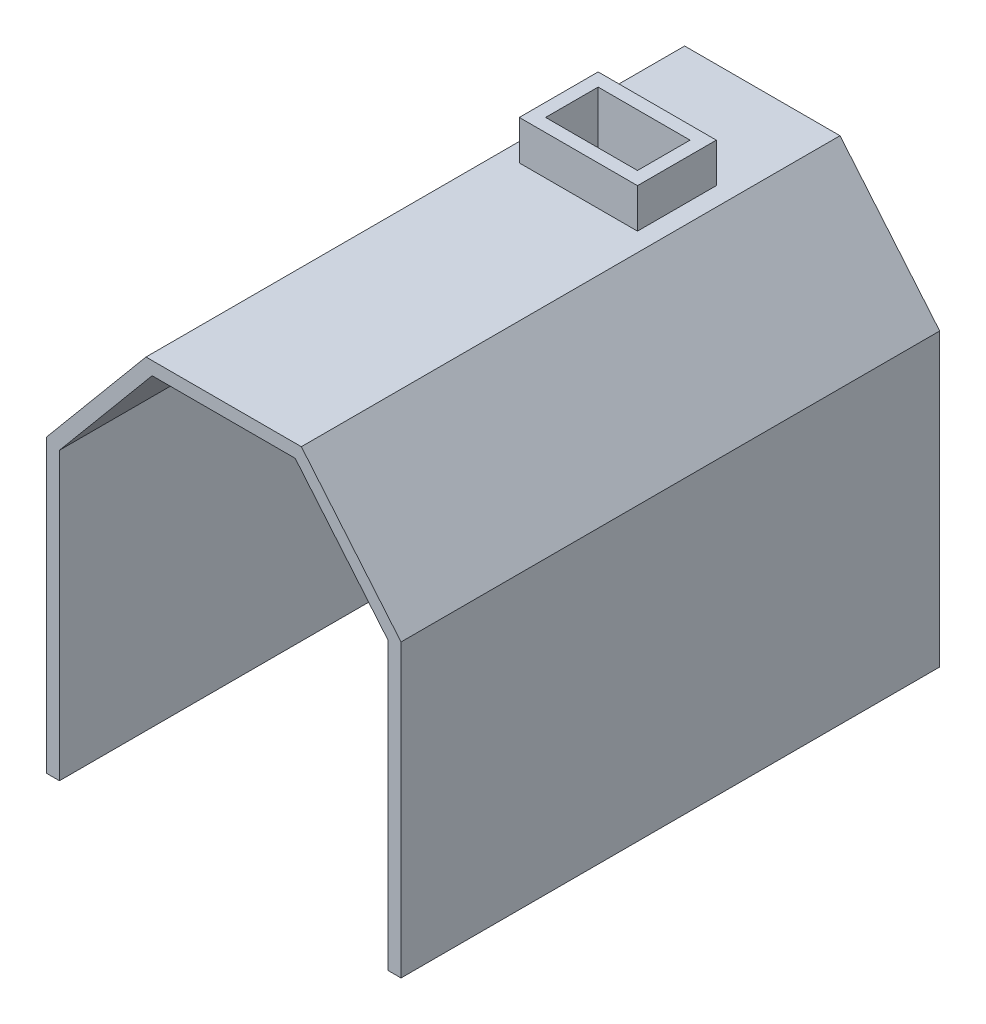
ISO-10303-21;
HEADER;
FILE_DESCRIPTION(('STEP AP214'),'2;1');
FILE_NAME('part.step','',(''),(''),'','','');
FILE_SCHEMA(('AUTOMOTIVE_DESIGN { 1 0 10303 214 1 1 1 1 }'));
ENDSEC;
DATA;
#1=APPLICATION_CONTEXT('core data for automotive mechanical design processes');
#2=APPLICATION_PROTOCOL_DEFINITION('international standard','automotive_design',2000,#1);
#3=PRODUCT_CONTEXT('',#1,'mechanical');
#4=PRODUCT('Part','Part','',(#3));
#5=PRODUCT_RELATED_PRODUCT_CATEGORY('part','',(#4));
#6=PRODUCT_DEFINITION_FORMATION('','',#4);
#7=PRODUCT_DEFINITION_CONTEXT('part definition',#1,'design');
#8=PRODUCT_DEFINITION('design','',#6,#7);
#9=PRODUCT_DEFINITION_SHAPE('','',#8);
#10=(LENGTH_UNIT() NAMED_UNIT(*) SI_UNIT(.MILLI.,.METRE.));
#11=(NAMED_UNIT(*) PLANE_ANGLE_UNIT() SI_UNIT($,.RADIAN.));
#12=(NAMED_UNIT(*) SI_UNIT($,.STERADIAN.) SOLID_ANGLE_UNIT());
#13=UNCERTAINTY_MEASURE_WITH_UNIT(LENGTH_MEASURE(1.E-05),#10,'distance_accuracy_value','');
#14=(GEOMETRIC_REPRESENTATION_CONTEXT(3) GLOBAL_UNCERTAINTY_ASSIGNED_CONTEXT((#13)) GLOBAL_UNIT_ASSIGNED_CONTEXT((#10,
#11,#12)) REPRESENTATION_CONTEXT('',''));
#15=CARTESIAN_POINT('',(0.,0.,0.));
#16=DIRECTION('',(0.,0.,1.));
#17=DIRECTION('',(1.,0.,0.));
#18=AXIS2_PLACEMENT_3D('',#15,#16,#17);
#19=CARTESIAN_POINT('',(-59.1248825999998,203.35,205.));
#20=DIRECTION('',(0.,-1.,0.));
#21=DIRECTION('',(0.,0.,-1.));
#22=AXIS2_PLACEMENT_3D('',#19,#20,#21);
#23=PLANE('',#22);
#24=DIRECTION('',(-1.,0.,0.));
#25=VECTOR('',#24,1.);
#26=CARTESIAN_POINT('',(-59.1248825999998,203.35,-205.));
#27=LINE('',#26,#25);
#28=CARTESIAN_POINT('',(59.1248825999997,203.35,-205.));
#29=VERTEX_POINT('',#28);
#30=CARTESIAN_POINT('',(-59.1248825999998,203.35,-205.));
#31=VERTEX_POINT('',#30);
#32=EDGE_CURVE('E296',#29,#31,#27,.T.);
#33=ORIENTED_EDGE('',*,*,#32,.T.);
#34=DIRECTION('',(0.,0.,-1.));
#35=VECTOR('',#34,1.);
#36=CARTESIAN_POINT('',(-59.1248825999998,203.35,205.));
#37=LINE('',#36,#35);
#38=CARTESIAN_POINT('',(-59.1248825999998,203.35,205.));
#39=VERTEX_POINT('',#38);
#40=EDGE_CURVE('E306',#39,#31,#37,.T.);
#41=ORIENTED_EDGE('',*,*,#40,.F.);
#42=DIRECTION('',(-1.,0.,0.));
#43=VECTOR('',#42,1.);
#44=CARTESIAN_POINT('',(-59.1248825999998,203.35,205.));
#45=LINE('',#44,#43);
#46=CARTESIAN_POINT('',(59.1248825999997,203.35,205.));
#47=VERTEX_POINT('',#46);
#48=EDGE_CURVE('E271',#47,#39,#45,.T.);
#49=ORIENTED_EDGE('',*,*,#48,.F.);
#50=DIRECTION('',(0.,0.,-1.));
#51=VECTOR('',#50,1.);
#52=CARTESIAN_POINT('',(59.1248825999997,203.35,205.));
#53=LINE('',#52,#51);
#54=EDGE_CURVE('E309',#47,#29,#53,.T.);
#55=ORIENTED_EDGE('',*,*,#54,.T.);
#56=EDGE_LOOP('',(#33,#41,#49,#55));
#57=FACE_BOUND('',#56,.T.);
#58=DIRECTION('',(1.,0.,0.));
#59=VECTOR('',#58,1.);
#60=CARTESIAN_POINT('',(-59.1248825999998,203.35,-65.));
#61=LINE('',#60,#59);
#62=CARTESIAN_POINT('',(-44.9749944578664,203.35,-65.));
#63=VERTEX_POINT('',#62);
#64=CARTESIAN_POINT('',(44.9749944578665,203.35,-65.));
#65=VERTEX_POINT('',#64);
#66=EDGE_CURVE('E210',#63,#65,#61,.T.);
#67=ORIENTED_EDGE('',*,*,#66,.F.);
#68=DIRECTION('',(0.,0.,1.));
#69=VECTOR('',#68,1.);
#70=CARTESIAN_POINT('',(-44.9749944578664,203.35,205.));
#71=LINE('',#70,#69);
#72=CARTESIAN_POINT('',(-44.9749944578664,203.35,-125.));
#73=VERTEX_POINT('',#72);
#74=EDGE_CURVE('E215',#73,#63,#71,.T.);
#75=ORIENTED_EDGE('',*,*,#74,.F.);
#76=DIRECTION('',(-1.,0.,0.));
#77=VECTOR('',#76,1.);
#78=CARTESIAN_POINT('',(-59.1248825999998,203.35,-125.));
#79=LINE('',#78,#77);
#80=CARTESIAN_POINT('',(44.9749944578665,203.35,-125.));
#81=VERTEX_POINT('',#80);
#82=EDGE_CURVE('E65',#81,#73,#79,.T.);
#83=ORIENTED_EDGE('',*,*,#82,.F.);
#84=DIRECTION('',(0.,0.,-1.));
#85=VECTOR('',#84,1.);
#86=CARTESIAN_POINT('',(44.9749944578665,203.35,205.));
#87=LINE('',#86,#85);
#88=EDGE_CURVE('E60',#65,#81,#87,.T.);
#89=ORIENTED_EDGE('',*,*,#88,.F.);
#90=EDGE_LOOP('',(#67,#75,#83,#89));
#91=FACE_BOUND('',#90,.T.);
#92=ADVANCED_FACE('F45',(#57,#91),#23,.F.);
#93=CARTESIAN_POINT('',(-54.4500000000001,193.35,205.));
#94=DIRECTION('',(0.,1.,0.));
#95=DIRECTION('',(0.,0.,1.));
#96=AXIS2_PLACEMENT_3D('',#93,#94,#95);
#97=PLANE('',#96);
#98=DIRECTION('',(1.,0.,0.));
#99=VECTOR('',#98,1.);
#100=CARTESIAN_POINT('',(-54.4500000000001,193.35,-205.));
#101=LINE('',#100,#99);
#102=CARTESIAN_POINT('',(-54.4500000000001,193.35,-205.));
#103=VERTEX_POINT('',#102);
#104=CARTESIAN_POINT('',(54.4499999999999,193.35,-205.));
#105=VERTEX_POINT('',#104);
#106=EDGE_CURVE('E284',#103,#105,#101,.T.);
#107=ORIENTED_EDGE('',*,*,#106,.T.);
#108=DIRECTION('',(0.,0.,-1.));
#109=VECTOR('',#108,1.);
#110=CARTESIAN_POINT('',(54.4499999999999,193.35,205.));
#111=LINE('',#110,#109);
#112=CARTESIAN_POINT('',(54.4499999999999,193.35,205.));
#113=VERTEX_POINT('',#112);
#114=EDGE_CURVE('E324',#113,#105,#111,.T.);
#115=ORIENTED_EDGE('',*,*,#114,.F.);
#116=DIRECTION('',(1.,0.,0.));
#117=VECTOR('',#116,1.);
#118=CARTESIAN_POINT('',(-54.4500000000001,193.35,205.));
#119=LINE('',#118,#117);
#120=CARTESIAN_POINT('',(-54.4500000000001,193.35,205.));
#121=VERTEX_POINT('',#120);
#122=EDGE_CURVE('E259',#121,#113,#119,.T.);
#123=ORIENTED_EDGE('',*,*,#122,.F.);
#124=DIRECTION('',(0.,0.,-1.));
#125=VECTOR('',#124,1.);
#126=CARTESIAN_POINT('',(-54.4500000000001,193.35,205.));
#127=LINE('',#126,#125);
#128=EDGE_CURVE('E327',#121,#103,#127,.T.);
#129=ORIENTED_EDGE('',*,*,#128,.T.);
#130=EDGE_LOOP('',(#107,#115,#123,#129));
#131=FACE_BOUND('',#130,.T.);
#132=DIRECTION('',(0.,0.,-1.));
#133=VECTOR('',#132,1.);
#134=CARTESIAN_POINT('',(-34.9749944578665,193.35,205.));
#135=LINE('',#134,#133);
#136=CARTESIAN_POINT('',(-34.9749944578664,193.35,-75.));
#137=VERTEX_POINT('',#136);
#138=CARTESIAN_POINT('',(-34.9749944578664,193.35,-115.));
#139=VERTEX_POINT('',#138);
#140=EDGE_CURVE('E247',#137,#139,#135,.T.);
#141=ORIENTED_EDGE('',*,*,#140,.F.);
#142=DIRECTION('',(-1.,0.,0.));
#143=VECTOR('',#142,1.);
#144=CARTESIAN_POINT('',(-54.4500000000001,193.35,-75.));
#145=LINE('',#144,#143);
#146=CARTESIAN_POINT('',(34.9749944578665,193.35,-75.0000000000001));
#147=VERTEX_POINT('',#146);
#148=EDGE_CURVE('E245',#147,#137,#145,.T.);
#149=ORIENTED_EDGE('',*,*,#148,.F.);
#150=DIRECTION('',(0.,0.,1.));
#151=VECTOR('',#150,1.);
#152=CARTESIAN_POINT('',(34.9749944578665,193.35,205.));
#153=LINE('',#152,#151);
#154=CARTESIAN_POINT('',(34.9749944578665,193.35,-115.));
#155=VERTEX_POINT('',#154);
#156=EDGE_CURVE('E188',#155,#147,#153,.T.);
#157=ORIENTED_EDGE('',*,*,#156,.F.);
#158=DIRECTION('',(1.,0.,0.));
#159=VECTOR('',#158,1.);
#160=CARTESIAN_POINT('',(-54.4500000000001,193.35,-115.));
#161=LINE('',#160,#159);
#162=EDGE_CURVE('E242',#139,#155,#161,.T.);
#163=ORIENTED_EDGE('',*,*,#162,.F.);
#164=EDGE_LOOP('',(#141,#149,#157,#163));
#165=FACE_BOUND('',#164,.T.);
#166=ADVANCED_FACE('F345',(#131,#165),#97,.F.);
#167=CARTESIAN_POINT('',(-135.,-108.94,205.));
#168=DIRECTION('',(0.,1.,0.));
#169=DIRECTION('',(-1.,0.,0.));
#170=AXIS2_PLACEMENT_3D('',#167,#168,#169);
#171=PLANE('',#170);
#172=DIRECTION('',(1.,0.,0.));
#173=VECTOR('',#172,1.);
#174=CARTESIAN_POINT('',(-135.,-108.94,-205.));
#175=LINE('',#174,#173);
#176=CARTESIAN_POINT('',(-135.,-108.94,-205.));
#177=VERTEX_POINT('',#176);
#178=CARTESIAN_POINT('',(-125.,-108.94,-205.));
#179=VERTEX_POINT('',#178);
#180=EDGE_CURVE('E250',#177,#179,#175,.T.);
#181=ORIENTED_EDGE('',*,*,#180,.T.);
#182=DIRECTION('',(0.,0.,-1.));
#183=VECTOR('',#182,1.);
#184=CARTESIAN_POINT('',(-125.,-108.94,205.));
#185=LINE('',#184,#183);
#186=CARTESIAN_POINT('',(-125.,-108.94,205.));
#187=VERTEX_POINT('',#186);
#188=EDGE_CURVE('E11',#187,#179,#185,.T.);
#189=ORIENTED_EDGE('',*,*,#188,.F.);
#190=DIRECTION('',(1.,0.,0.));
#191=VECTOR('',#190,1.);
#192=CARTESIAN_POINT('',(-135.,-108.94,205.));
#193=LINE('',#192,#191);
#194=CARTESIAN_POINT('',(-135.,-108.94,205.));
#195=VERTEX_POINT('',#194);
#196=EDGE_CURVE('E251',#195,#187,#193,.T.);
#197=ORIENTED_EDGE('',*,*,#196,.F.);
#198=DIRECTION('',(0.,0.,-1.));
#199=VECTOR('',#198,1.);
#200=CARTESIAN_POINT('',(-135.,-108.94,205.));
#201=LINE('',#200,#199);
#202=EDGE_CURVE('E277',#195,#177,#201,.T.);
#203=ORIENTED_EDGE('',*,*,#202,.T.);
#204=EDGE_LOOP('',(#181,#189,#197,#203));
#205=FACE_BOUND('',#204,.T.);
#206=ADVANCED_FACE('F47',(#205),#171,.F.);
#207=CARTESIAN_POINT('',(-125.,108.94,205.));
#208=DIRECTION('',(-1.,0.,0.));
#209=DIRECTION('',(0.,-1.,0.));
#210=AXIS2_PLACEMENT_3D('',#207,#208,#209);
#211=PLANE('',#210);
#212=DIRECTION('',(0.,1.,0.));
#213=VECTOR('',#212,1.);
#214=CARTESIAN_POINT('',(-125.,108.94,-205.));
#215=LINE('',#214,#213);
#216=CARTESIAN_POINT('',(-125.,108.94,-205.));
#217=VERTEX_POINT('',#216);
#218=EDGE_CURVE('E280',#179,#217,#215,.T.);
#219=ORIENTED_EDGE('',*,*,#218,.T.);
#220=DIRECTION('',(0.,0.,-1.));
#221=VECTOR('',#220,1.);
#222=CARTESIAN_POINT('',(-125.,108.94,205.));
#223=LINE('',#222,#221);
#224=CARTESIAN_POINT('',(-125.,108.94,205.));
#225=VERTEX_POINT('',#224);
#226=EDGE_CURVE('E53',#225,#217,#223,.T.);
#227=ORIENTED_EDGE('',*,*,#226,.F.);
#228=DIRECTION('',(0.,1.,0.));
#229=VECTOR('',#228,1.);
#230=CARTESIAN_POINT('',(-125.,108.94,205.));
#231=LINE('',#230,#229);
#232=EDGE_CURVE('E254',#187,#225,#231,.T.);
#233=ORIENTED_EDGE('',*,*,#232,.F.);
#234=ORIENTED_EDGE('',*,*,#188,.T.);
#235=EDGE_LOOP('',(#219,#227,#233,#234));
#236=FACE_BOUND('',#235,.T.);
#237=ADVANCED_FACE('F358',(#236),#211,.F.);
#238=CARTESIAN_POINT('',(-125.,108.94,205.));
#239=DIRECTION('',(-0.767289111479314,0.641301348357607,0.));
#240=DIRECTION('',(-0.641301348357607,-0.767289111479314,0.));
#241=AXIS2_PLACEMENT_3D('',#238,#239,#240);
#242=PLANE('',#241);
#243=DIRECTION('',(0.641301348357607,0.767289111479314,0.));
#244=VECTOR('',#243,1.);
#245=CARTESIAN_POINT('',(-125.,108.94,-205.));
#246=LINE('',#245,#244);
#247=EDGE_CURVE('E282',#217,#103,#246,.T.);
#248=ORIENTED_EDGE('',*,*,#247,.T.);
#249=ORIENTED_EDGE('',*,*,#128,.F.);
#250=DIRECTION('',(0.641301348357607,0.767289111479314,0.));
#251=VECTOR('',#250,1.);
#252=CARTESIAN_POINT('',(-125.,108.94,205.));
#253=LINE('',#252,#251);
#254=EDGE_CURVE('E257',#225,#121,#253,.T.);
#255=ORIENTED_EDGE('',*,*,#254,.F.);
#256=ORIENTED_EDGE('',*,*,#226,.T.);
#257=EDGE_LOOP('',(#248,#249,#255,#256));
#258=FACE_BOUND('',#257,.T.);
#259=ADVANCED_FACE('F334',(#258),#242,.F.);
#260=CARTESIAN_POINT('',(125.,108.94,205.));
#261=DIRECTION('',(0.767289111479314,0.641301348357607,0.));
#262=DIRECTION('',(-0.641301348357607,0.767289111479314,0.));
#263=AXIS2_PLACEMENT_3D('',#260,#261,#262);
#264=PLANE('',#263);
#265=DIRECTION('',(0.641301348357607,-0.767289111479314,0.));
#266=VECTOR('',#265,1.);
#267=CARTESIAN_POINT('',(125.,108.94,-205.));
#268=LINE('',#267,#266);
#269=CARTESIAN_POINT('',(125.,108.94,-205.));
#270=VERTEX_POINT('',#269);
#271=EDGE_CURVE('E286',#105,#270,#268,.T.);
#272=ORIENTED_EDGE('',*,*,#271,.T.);
#273=DIRECTION('',(0.,0.,-1.));
#274=VECTOR('',#273,1.);
#275=CARTESIAN_POINT('',(125.,108.94,205.));
#276=LINE('',#275,#274);
#277=CARTESIAN_POINT('',(125.,108.94,205.));
#278=VERTEX_POINT('',#277);
#279=EDGE_CURVE('E321',#278,#270,#276,.T.);
#280=ORIENTED_EDGE('',*,*,#279,.F.);
#281=DIRECTION('',(0.641301348357607,-0.767289111479314,0.));
#282=VECTOR('',#281,1.);
#283=CARTESIAN_POINT('',(125.,108.94,205.));
#284=LINE('',#283,#282);
#285=EDGE_CURVE('E261',#113,#278,#284,.T.);
#286=ORIENTED_EDGE('',*,*,#285,.F.);
#287=ORIENTED_EDGE('',*,*,#114,.T.);
#288=EDGE_LOOP('',(#272,#280,#286,#287));
#289=FACE_BOUND('',#288,.T.);
#290=ADVANCED_FACE('F350',(#289),#264,.F.);
#291=CARTESIAN_POINT('',(125.,108.94,205.));
#292=DIRECTION('',(1.,0.,0.));
#293=DIRECTION('',(0.,1.,0.));
#294=AXIS2_PLACEMENT_3D('',#291,#292,#293);
#295=PLANE('',#294);
#296=DIRECTION('',(0.,-1.,0.));
#297=VECTOR('',#296,1.);
#298=CARTESIAN_POINT('',(125.,108.94,-205.));
#299=LINE('',#298,#297);
#300=CARTESIAN_POINT('',(125.,-108.94,-205.));
#301=VERTEX_POINT('',#300);
#302=EDGE_CURVE('E288',#270,#301,#299,.T.);
#303=ORIENTED_EDGE('',*,*,#302,.T.);
#304=DIRECTION('',(0.,0.,-1.));
#305=VECTOR('',#304,1.);
#306=CARTESIAN_POINT('',(125.,-108.94,205.));
#307=LINE('',#306,#305);
#308=CARTESIAN_POINT('',(125.,-108.94,205.));
#309=VERTEX_POINT('',#308);
#310=EDGE_CURVE('E318',#309,#301,#307,.T.);
#311=ORIENTED_EDGE('',*,*,#310,.F.);
#312=DIRECTION('',(0.,-1.,0.));
#313=VECTOR('',#312,1.);
#314=CARTESIAN_POINT('',(125.,108.94,205.));
#315=LINE('',#314,#313);
#316=EDGE_CURVE('E263',#278,#309,#315,.T.);
#317=ORIENTED_EDGE('',*,*,#316,.F.);
#318=ORIENTED_EDGE('',*,*,#279,.T.);
#319=EDGE_LOOP('',(#303,#311,#317,#318));
#320=FACE_BOUND('',#319,.T.);
#321=ADVANCED_FACE('F390',(#320),#295,.F.);
#322=CARTESIAN_POINT('',(125.,-108.94,205.));
#323=DIRECTION('',(0.,1.,0.));
#324=DIRECTION('',(0.,0.,1.));
#325=AXIS2_PLACEMENT_3D('',#322,#323,#324);
#326=PLANE('',#325);
#327=DIRECTION('',(1.,0.,0.));
#328=VECTOR('',#327,1.);
#329=CARTESIAN_POINT('',(125.,-108.94,-205.));
#330=LINE('',#329,#328);
#331=CARTESIAN_POINT('',(135.,-108.94,-205.));
#332=VERTEX_POINT('',#331);
#333=EDGE_CURVE('E290',#301,#332,#330,.T.);
#334=ORIENTED_EDGE('',*,*,#333,.T.);
#335=DIRECTION('',(0.,0.,-1.));
#336=VECTOR('',#335,1.);
#337=CARTESIAN_POINT('',(135.,-108.94,205.));
#338=LINE('',#337,#336);
#339=CARTESIAN_POINT('',(135.,-108.94,205.));
#340=VERTEX_POINT('',#339);
#341=EDGE_CURVE('E315',#340,#332,#338,.T.);
#342=ORIENTED_EDGE('',*,*,#341,.F.);
#343=DIRECTION('',(1.,0.,0.));
#344=VECTOR('',#343,1.);
#345=CARTESIAN_POINT('',(125.,-108.94,205.));
#346=LINE('',#345,#344);
#347=EDGE_CURVE('E265',#309,#340,#346,.T.);
#348=ORIENTED_EDGE('',*,*,#347,.F.);
#349=ORIENTED_EDGE('',*,*,#310,.T.);
#350=EDGE_LOOP('',(#334,#342,#348,#349));
#351=FACE_BOUND('',#350,.T.);
#352=ADVANCED_FACE('F388',(#351),#326,.F.);
#353=CARTESIAN_POINT('',(135.,112.568729132048,205.));
#354=DIRECTION('',(-1.,0.,0.));
#355=DIRECTION('',(0.,0.,1.));
#356=AXIS2_PLACEMENT_3D('',#353,#354,#355);
#357=PLANE('',#356);
#358=DIRECTION('',(0.,1.,0.));
#359=VECTOR('',#358,1.);
#360=CARTESIAN_POINT('',(135.,112.568729132048,-205.));
#361=LINE('',#360,#359);
#362=CARTESIAN_POINT('',(135.,112.568729132048,-205.));
#363=VERTEX_POINT('',#362);
#364=EDGE_CURVE('E292',#332,#363,#361,.T.);
#365=ORIENTED_EDGE('',*,*,#364,.T.);
#366=DIRECTION('',(0.,0.,-1.));
#367=VECTOR('',#366,1.);
#368=CARTESIAN_POINT('',(135.,112.568729132048,205.));
#369=LINE('',#368,#367);
#370=CARTESIAN_POINT('',(135.,112.568729132048,205.));
#371=VERTEX_POINT('',#370);
#372=EDGE_CURVE('E312',#371,#363,#369,.T.);
#373=ORIENTED_EDGE('',*,*,#372,.F.);
#374=DIRECTION('',(0.,1.,0.));
#375=VECTOR('',#374,1.);
#376=CARTESIAN_POINT('',(135.,112.568729132048,205.));
#377=LINE('',#376,#375);
#378=EDGE_CURVE('E267',#340,#371,#377,.T.);
#379=ORIENTED_EDGE('',*,*,#378,.F.);
#380=ORIENTED_EDGE('',*,*,#341,.T.);
#381=EDGE_LOOP('',(#365,#373,#379,#380));
#382=FACE_BOUND('',#381,.T.);
#383=ADVANCED_FACE('F384',(#382),#357,.F.);
#384=CARTESIAN_POINT('',(135.,112.568729132048,205.));
#385=DIRECTION('',(-0.767289111479314,-0.641301348357607,0.));
#386=DIRECTION('',(0.641301348357607,-0.767289111479314,0.));
#387=AXIS2_PLACEMENT_3D('',#384,#385,#386);
#388=PLANE('',#387);
#389=DIRECTION('',(-0.641301348357607,0.767289111479314,0.));
#390=VECTOR('',#389,1.);
#391=CARTESIAN_POINT('',(135.,112.568729132048,-205.));
#392=LINE('',#391,#390);
#393=EDGE_CURVE('E294',#363,#29,#392,.T.);
#394=ORIENTED_EDGE('',*,*,#393,.T.);
#395=ORIENTED_EDGE('',*,*,#54,.F.);
#396=DIRECTION('',(-0.641301348357607,0.767289111479314,0.));
#397=VECTOR('',#396,1.);
#398=CARTESIAN_POINT('',(135.,112.568729132048,205.));
#399=LINE('',#398,#397);
#400=EDGE_CURVE('E269',#371,#47,#399,.T.);
#401=ORIENTED_EDGE('',*,*,#400,.F.);
#402=ORIENTED_EDGE('',*,*,#372,.T.);
#403=EDGE_LOOP('',(#394,#395,#401,#402));
#404=FACE_BOUND('',#403,.T.);
#405=ADVANCED_FACE('F379',(#404),#388,.F.);
#406=CARTESIAN_POINT('',(-135.,112.568729132048,205.));
#407=DIRECTION('',(0.767289111479314,-0.641301348357607,0.));
#408=DIRECTION('',(0.641301348357607,0.767289111479314,0.));
#409=AXIS2_PLACEMENT_3D('',#406,#407,#408);
#410=PLANE('',#409);
#411=DIRECTION('',(-0.641301348357607,-0.767289111479314,0.));
#412=VECTOR('',#411,1.);
#413=CARTESIAN_POINT('',(-135.,112.568729132048,-205.));
#414=LINE('',#413,#412);
#415=CARTESIAN_POINT('',(-135.,112.568729132048,-205.));
#416=VERTEX_POINT('',#415);
#417=EDGE_CURVE('E298',#31,#416,#414,.T.);
#418=ORIENTED_EDGE('',*,*,#417,.T.);
#419=DIRECTION('',(0.,0.,-1.));
#420=VECTOR('',#419,1.);
#421=CARTESIAN_POINT('',(-135.,112.568729132048,205.));
#422=LINE('',#421,#420);
#423=CARTESIAN_POINT('',(-135.,112.568729132048,205.));
#424=VERTEX_POINT('',#423);
#425=EDGE_CURVE('E303',#424,#416,#422,.T.);
#426=ORIENTED_EDGE('',*,*,#425,.F.);
#427=DIRECTION('',(-0.641301348357607,-0.767289111479314,0.));
#428=VECTOR('',#427,1.);
#429=CARTESIAN_POINT('',(-135.,112.568729132048,205.));
#430=LINE('',#429,#428);
#431=EDGE_CURVE('E273',#39,#424,#430,.T.);
#432=ORIENTED_EDGE('',*,*,#431,.F.);
#433=ORIENTED_EDGE('',*,*,#40,.T.);
#434=EDGE_LOOP('',(#418,#426,#432,#433));
#435=FACE_BOUND('',#434,.T.);
#436=ADVANCED_FACE('F370',(#435),#410,.F.);
#437=CARTESIAN_POINT('',(-135.,112.568729132048,205.));
#438=DIRECTION('',(1.,0.,0.));
#439=DIRECTION('',(0.,0.,-1.));
#440=AXIS2_PLACEMENT_3D('',#437,#438,#439);
#441=PLANE('',#440);
#442=DIRECTION('',(0.,-1.,0.));
#443=VECTOR('',#442,1.);
#444=CARTESIAN_POINT('',(-135.,112.568729132048,-205.));
#445=LINE('',#444,#443);
#446=EDGE_CURVE('E255',#416,#177,#445,.T.);
#447=ORIENTED_EDGE('',*,*,#446,.T.);
#448=ORIENTED_EDGE('',*,*,#202,.F.);
#449=DIRECTION('',(0.,-1.,0.));
#450=VECTOR('',#449,1.);
#451=CARTESIAN_POINT('',(-135.,112.568729132048,205.));
#452=LINE('',#451,#450);
#453=EDGE_CURVE('E275',#424,#195,#452,.T.);
#454=ORIENTED_EDGE('',*,*,#453,.F.);
#455=ORIENTED_EDGE('',*,*,#425,.T.);
#456=EDGE_LOOP('',(#447,#448,#454,#455));
#457=FACE_BOUND('',#456,.T.);
#458=ADVANCED_FACE('F365',(#457),#441,.F.);
#459=CARTESIAN_POINT('',(0.,0.,205.));
#460=DIRECTION('',(0.,0.,-1.));
#461=DIRECTION('',(-1.,0.,0.));
#462=AXIS2_PLACEMENT_3D('',#459,#460,#461);
#463=PLANE('',#462);
#464=ORIENTED_EDGE('',*,*,#196,.T.);
#465=ORIENTED_EDGE('',*,*,#232,.T.);
#466=ORIENTED_EDGE('',*,*,#254,.T.);
#467=ORIENTED_EDGE('',*,*,#122,.T.);
#468=ORIENTED_EDGE('',*,*,#285,.T.);
#469=ORIENTED_EDGE('',*,*,#316,.T.);
#470=ORIENTED_EDGE('',*,*,#347,.T.);
#471=ORIENTED_EDGE('',*,*,#378,.T.);
#472=ORIENTED_EDGE('',*,*,#400,.T.);
#473=ORIENTED_EDGE('',*,*,#48,.T.);
#474=ORIENTED_EDGE('',*,*,#431,.T.);
#475=ORIENTED_EDGE('',*,*,#453,.T.);
#476=EDGE_LOOP('',(#464,#465,#466,#467,#468,#469,#470,#471,#472,#473,#474,#475));
#477=FACE_BOUND('',#476,.T.);
#478=ADVANCED_FACE('F354',(#477),#463,.F.);
#479=CARTESIAN_POINT('',(0.,0.,-205.));
#480=DIRECTION('',(0.,0.,-1.));
#481=DIRECTION('',(-1.,0.,0.));
#482=AXIS2_PLACEMENT_3D('',#479,#480,#481);
#483=PLANE('',#482);
#484=ORIENTED_EDGE('',*,*,#180,.F.);
#485=ORIENTED_EDGE('',*,*,#446,.F.);
#486=ORIENTED_EDGE('',*,*,#417,.F.);
#487=ORIENTED_EDGE('',*,*,#32,.F.);
#488=ORIENTED_EDGE('',*,*,#393,.F.);
#489=ORIENTED_EDGE('',*,*,#364,.F.);
#490=ORIENTED_EDGE('',*,*,#333,.F.);
#491=ORIENTED_EDGE('',*,*,#302,.F.);
#492=ORIENTED_EDGE('',*,*,#271,.F.);
#493=ORIENTED_EDGE('',*,*,#106,.F.);
#494=ORIENTED_EDGE('',*,*,#247,.F.);
#495=ORIENTED_EDGE('',*,*,#218,.F.);
#496=EDGE_LOOP('',(#484,#485,#486,#487,#488,#489,#490,#491,#492,#493,#494,#495));
#497=FACE_BOUND('',#496,.T.);
#498=ADVANCED_FACE('F340',(#497),#483,.T.);
#499=CARTESIAN_POINT('',(-34.9749944578664,203.35,-115.));
#500=DIRECTION('',(1.,0.,0.));
#501=DIRECTION('',(0.,0.,-1.));
#502=AXIS2_PLACEMENT_3D('',#499,#500,#501);
#503=PLANE('',#502);
#504=ORIENTED_EDGE('',*,*,#140,.T.);
#505=DIRECTION('',(0.,-1.,0.));
#506=VECTOR('',#505,1.);
#507=CARTESIAN_POINT('',(-34.9749944578664,203.35,-115.));
#508=LINE('',#507,#506);
#509=CARTESIAN_POINT('',(-34.9749944578664,233.35,-115.));
#510=VERTEX_POINT('',#509);
#511=EDGE_CURVE('E238',#510,#139,#508,.T.);
#512=ORIENTED_EDGE('',*,*,#511,.F.);
#513=DIRECTION('',(0.,0.,1.));
#514=VECTOR('',#513,1.);
#515=CARTESIAN_POINT('',(-34.9749944578665,233.35,205.));
#516=LINE('',#515,#514);
#517=CARTESIAN_POINT('',(-34.9749944578664,233.35,-75.));
#518=VERTEX_POINT('',#517);
#519=EDGE_CURVE('E206',#510,#518,#516,.T.);
#520=ORIENTED_EDGE('',*,*,#519,.T.);
#521=DIRECTION('',(0.,-1.,0.));
#522=VECTOR('',#521,1.);
#523=CARTESIAN_POINT('',(-34.9749944578664,203.35,-75.));
#524=LINE('',#523,#522);
#525=EDGE_CURVE('E191',#518,#137,#524,.T.);
#526=ORIENTED_EDGE('',*,*,#525,.T.);
#527=EDGE_LOOP('',(#504,#512,#520,#526));
#528=FACE_BOUND('',#527,.T.);
#529=ADVANCED_FACE('F441',(#528),#503,.T.);
#530=CARTESIAN_POINT('',(34.9749944578665,203.35,-75.0000000000001));
#531=DIRECTION('',(0.,0.,-1.));
#532=DIRECTION('',(-1.,0.,0.));
#533=AXIS2_PLACEMENT_3D('',#530,#531,#532);
#534=PLANE('',#533);
#535=ORIENTED_EDGE('',*,*,#148,.T.);
#536=ORIENTED_EDGE('',*,*,#525,.F.);
#537=DIRECTION('',(1.,0.,0.));
#538=VECTOR('',#537,1.);
#539=CARTESIAN_POINT('',(-59.1248825999999,233.35,-75.));
#540=LINE('',#539,#538);
#541=CARTESIAN_POINT('',(34.9749944578665,233.35,-75.0000000000001));
#542=VERTEX_POINT('',#541);
#543=EDGE_CURVE('E195',#518,#542,#540,.T.);
#544=ORIENTED_EDGE('',*,*,#543,.T.);
#545=DIRECTION('',(0.,-1.,0.));
#546=VECTOR('',#545,1.);
#547=CARTESIAN_POINT('',(34.9749944578665,203.35,-75.0000000000001));
#548=LINE('',#547,#546);
#549=EDGE_CURVE('E180',#542,#147,#548,.T.);
#550=ORIENTED_EDGE('',*,*,#549,.T.);
#551=EDGE_LOOP('',(#535,#536,#544,#550));
#552=FACE_BOUND('',#551,.T.);
#553=ADVANCED_FACE('F196',(#552),#534,.T.);
#554=CARTESIAN_POINT('',(34.9749944578665,203.35,-115.));
#555=DIRECTION('',(-1.,0.,0.));
#556=DIRECTION('',(0.,0.,1.));
#557=AXIS2_PLACEMENT_3D('',#554,#555,#556);
#558=PLANE('',#557);
#559=ORIENTED_EDGE('',*,*,#156,.T.);
#560=ORIENTED_EDGE('',*,*,#549,.F.);
#561=DIRECTION('',(0.,0.,-1.));
#562=VECTOR('',#561,1.);
#563=CARTESIAN_POINT('',(34.9749944578665,233.35,205.));
#564=LINE('',#563,#562);
#565=CARTESIAN_POINT('',(34.9749944578665,233.35,-115.));
#566=VERTEX_POINT('',#565);
#567=EDGE_CURVE('E185',#542,#566,#564,.T.);
#568=ORIENTED_EDGE('',*,*,#567,.T.);
#569=DIRECTION('',(0.,-1.,0.));
#570=VECTOR('',#569,1.);
#571=CARTESIAN_POINT('',(34.9749944578665,203.35,-115.));
#572=LINE('',#571,#570);
#573=EDGE_CURVE('E192',#566,#155,#572,.T.);
#574=ORIENTED_EDGE('',*,*,#573,.T.);
#575=EDGE_LOOP('',(#559,#560,#568,#574));
#576=FACE_BOUND('',#575,.T.);
#577=ADVANCED_FACE('F182',(#576),#558,.T.);
#578=CARTESIAN_POINT('',(34.9749944578665,203.35,-115.));
#579=DIRECTION('',(0.,0.,1.));
#580=DIRECTION('',(1.,0.,0.));
#581=AXIS2_PLACEMENT_3D('',#578,#579,#580);
#582=PLANE('',#581);
#583=ORIENTED_EDGE('',*,*,#162,.T.);
#584=ORIENTED_EDGE('',*,*,#573,.F.);
#585=DIRECTION('',(-1.,0.,0.));
#586=VECTOR('',#585,1.);
#587=CARTESIAN_POINT('',(-59.1248825999999,233.35,-115.));
#588=LINE('',#587,#586);
#589=EDGE_CURVE('E204',#566,#510,#588,.T.);
#590=ORIENTED_EDGE('',*,*,#589,.T.);
#591=ORIENTED_EDGE('',*,*,#511,.T.);
#592=EDGE_LOOP('',(#583,#584,#590,#591));
#593=FACE_BOUND('',#592,.T.);
#594=ADVANCED_FACE('F462',(#593),#582,.T.);
#595=CARTESIAN_POINT('',(0.,233.35,0.));
#596=DIRECTION('',(0.,1.,0.));
#597=DIRECTION('',(0.,0.,1.));
#598=AXIS2_PLACEMENT_3D('',#595,#596,#597);
#599=PLANE('',#598);
#600=DIRECTION('',(1.,0.,0.));
#601=VECTOR('',#600,1.);
#602=CARTESIAN_POINT('',(-59.1248825999998,233.35,-65.));
#603=LINE('',#602,#601);
#604=CARTESIAN_POINT('',(-44.9749944578664,233.35,-65.));
#605=VERTEX_POINT('',#604);
#606=CARTESIAN_POINT('',(44.9749944578665,233.35,-65.));
#607=VERTEX_POINT('',#606);
#608=EDGE_CURVE('E211',#605,#607,#603,.T.);
#609=ORIENTED_EDGE('',*,*,#608,.T.);
#610=DIRECTION('',(0.,0.,-1.));
#611=VECTOR('',#610,1.);
#612=CARTESIAN_POINT('',(44.9749944578665,233.35,205.));
#613=LINE('',#612,#611);
#614=CARTESIAN_POINT('',(44.9749944578665,233.35,-125.));
#615=VERTEX_POINT('',#614);
#616=EDGE_CURVE('E214',#607,#615,#613,.T.);
#617=ORIENTED_EDGE('',*,*,#616,.T.);
#618=DIRECTION('',(-1.,0.,0.));
#619=VECTOR('',#618,1.);
#620=CARTESIAN_POINT('',(-59.1248825999998,233.35,-125.));
#621=LINE('',#620,#619);
#622=CARTESIAN_POINT('',(-44.9749944578664,233.35,-125.));
#623=VERTEX_POINT('',#622);
#624=EDGE_CURVE('E217',#615,#623,#621,.T.);
#625=ORIENTED_EDGE('',*,*,#624,.T.);
#626=DIRECTION('',(0.,0.,1.));
#627=VECTOR('',#626,1.);
#628=CARTESIAN_POINT('',(-44.9749944578664,233.35,205.));
#629=LINE('',#628,#627);
#630=EDGE_CURVE('E219',#623,#605,#629,.T.);
#631=ORIENTED_EDGE('',*,*,#630,.T.);
#632=EDGE_LOOP('',(#609,#617,#625,#631));
#633=FACE_BOUND('',#632,.T.);
#634=ORIENTED_EDGE('',*,*,#567,.F.);
#635=ORIENTED_EDGE('',*,*,#543,.F.);
#636=ORIENTED_EDGE('',*,*,#519,.F.);
#637=ORIENTED_EDGE('',*,*,#589,.F.);
#638=EDGE_LOOP('',(#634,#635,#636,#637));
#639=FACE_BOUND('',#638,.T.);
#640=ADVANCED_FACE('F202',(#633,#639),#599,.T.);
#641=CARTESIAN_POINT('',(-59.1248825999998,233.35,-65.));
#642=DIRECTION('',(0.,0.,-1.));
#643=DIRECTION('',(-1.,0.,0.));
#644=AXIS2_PLACEMENT_3D('',#641,#642,#643);
#645=PLANE('',#644);
#646=ORIENTED_EDGE('',*,*,#66,.T.);
#647=DIRECTION('',(0.,-1.,0.));
#648=VECTOR('',#647,1.);
#649=CARTESIAN_POINT('',(44.9749944578665,233.35,-65.));
#650=LINE('',#649,#648);
#651=EDGE_CURVE('E236',#607,#65,#650,.T.);
#652=ORIENTED_EDGE('',*,*,#651,.F.);
#653=ORIENTED_EDGE('',*,*,#608,.F.);
#654=DIRECTION('',(0.,-1.,0.));
#655=VECTOR('',#654,1.);
#656=CARTESIAN_POINT('',(-44.9749944578664,233.35,-65.));
#657=LINE('',#656,#655);
#658=EDGE_CURVE('E221',#605,#63,#657,.T.);
#659=ORIENTED_EDGE('',*,*,#658,.T.);
#660=EDGE_LOOP('',(#646,#652,#653,#659));
#661=FACE_BOUND('',#660,.T.);
#662=ADVANCED_FACE('F476',(#661),#645,.F.);
#663=CARTESIAN_POINT('',(44.9749944578665,233.35,205.));
#664=DIRECTION('',(-1.,0.,0.));
#665=DIRECTION('',(0.,0.,1.));
#666=AXIS2_PLACEMENT_3D('',#663,#664,#665);
#667=PLANE('',#666);
#668=ORIENTED_EDGE('',*,*,#88,.T.);
#669=DIRECTION('',(0.,-1.,0.));
#670=VECTOR('',#669,1.);
#671=CARTESIAN_POINT('',(44.9749944578665,233.35,-125.));
#672=LINE('',#671,#670);
#673=EDGE_CURVE('E233',#615,#81,#672,.T.);
#674=ORIENTED_EDGE('',*,*,#673,.F.);
#675=ORIENTED_EDGE('',*,*,#616,.F.);
#676=ORIENTED_EDGE('',*,*,#651,.T.);
#677=EDGE_LOOP('',(#668,#674,#675,#676));
#678=FACE_BOUND('',#677,.T.);
#679=ADVANCED_FACE('F484',(#678),#667,.F.);
#680=CARTESIAN_POINT('',(-59.1248825999998,233.35,-125.));
#681=DIRECTION('',(0.,0.,1.));
#682=DIRECTION('',(1.,0.,0.));
#683=AXIS2_PLACEMENT_3D('',#680,#681,#682);
#684=PLANE('',#683);
#685=ORIENTED_EDGE('',*,*,#82,.T.);
#686=DIRECTION('',(0.,-1.,0.));
#687=VECTOR('',#686,1.);
#688=CARTESIAN_POINT('',(-44.9749944578664,233.35,-125.));
#689=LINE('',#688,#687);
#690=EDGE_CURVE('E230',#623,#73,#689,.T.);
#691=ORIENTED_EDGE('',*,*,#690,.F.);
#692=ORIENTED_EDGE('',*,*,#624,.F.);
#693=ORIENTED_EDGE('',*,*,#673,.T.);
#694=EDGE_LOOP('',(#685,#691,#692,#693));
#695=FACE_BOUND('',#694,.T.);
#696=ADVANCED_FACE('F492',(#695),#684,.F.);
#697=CARTESIAN_POINT('',(-44.9749944578664,233.35,205.));
#698=DIRECTION('',(1.,0.,0.));
#699=DIRECTION('',(0.,0.,-1.));
#700=AXIS2_PLACEMENT_3D('',#697,#698,#699);
#701=PLANE('',#700);
#702=ORIENTED_EDGE('',*,*,#74,.T.);
#703=ORIENTED_EDGE('',*,*,#658,.F.);
#704=ORIENTED_EDGE('',*,*,#630,.F.);
#705=ORIENTED_EDGE('',*,*,#690,.T.);
#706=EDGE_LOOP('',(#702,#703,#704,#705));
#707=FACE_BOUND('',#706,.T.);
#708=ADVANCED_FACE('F500',(#707),#701,.F.);
#709=CLOSED_SHELL('',(#92,#166,#206,#237,#259,#290,#321,#352,#383,#405,#436,#458,#478,#498,#529,
#553,#577,#594,#640,#662,#679,#696,#708));
#710=MANIFOLD_SOLID_BREP('B2',#709);
#711=ADVANCED_BREP_SHAPE_REPRESENTATION('',(#18,#710),#14);
#712=SHAPE_DEFINITION_REPRESENTATION(#9,#711);
ENDSEC;
END-ISO-10303-21;
